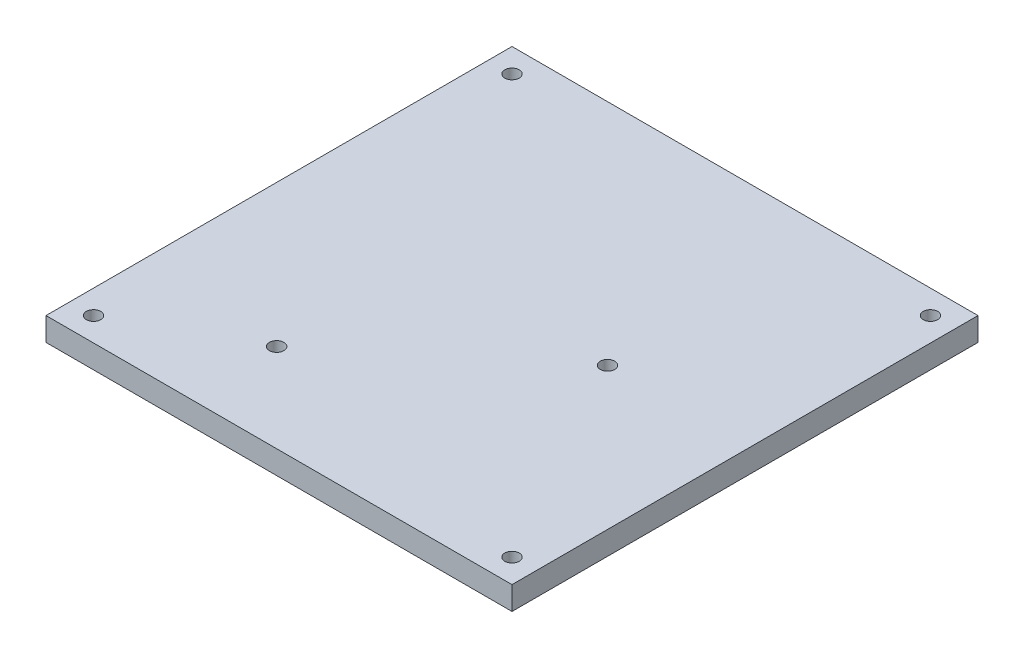
ISO-10303-21;
HEADER;
FILE_DESCRIPTION(('STEP AP214'),'2;1');
FILE_NAME('part.step','',(''),(''),'','','');
FILE_SCHEMA(('AUTOMOTIVE_DESIGN { 1 0 10303 214 1 1 1 1 }'));
ENDSEC;
DATA;
#1=APPLICATION_CONTEXT('core data for automotive mechanical design processes');
#2=APPLICATION_PROTOCOL_DEFINITION('international standard','automotive_design',2000,#1);
#3=PRODUCT_CONTEXT('',#1,'mechanical');
#4=PRODUCT('Part','Part','',(#3));
#5=PRODUCT_RELATED_PRODUCT_CATEGORY('part','',(#4));
#6=PRODUCT_DEFINITION_FORMATION('','',#4);
#7=PRODUCT_DEFINITION_CONTEXT('part definition',#1,'design');
#8=PRODUCT_DEFINITION('design','',#6,#7);
#9=PRODUCT_DEFINITION_SHAPE('','',#8);
#10=(LENGTH_UNIT() NAMED_UNIT(*) SI_UNIT(.MILLI.,.METRE.));
#11=(NAMED_UNIT(*) PLANE_ANGLE_UNIT() SI_UNIT($,.RADIAN.));
#12=(NAMED_UNIT(*) SI_UNIT($,.STERADIAN.) SOLID_ANGLE_UNIT());
#13=UNCERTAINTY_MEASURE_WITH_UNIT(LENGTH_MEASURE(1.E-05),#10,'distance_accuracy_value','');
#14=(GEOMETRIC_REPRESENTATION_CONTEXT(3) GLOBAL_UNCERTAINTY_ASSIGNED_CONTEXT((#13)) GLOBAL_UNIT_ASSIGNED_CONTEXT((#10,
#11,#12)) REPRESENTATION_CONTEXT('',''));
#15=CARTESIAN_POINT('',(0.,0.,0.));
#16=DIRECTION('',(0.,0.,1.));
#17=DIRECTION('',(1.,0.,0.));
#18=AXIS2_PLACEMENT_3D('',#15,#16,#17);
#19=CARTESIAN_POINT('',(0.,5.,0.));
#20=DIRECTION('',(0.,-1.,0.));
#21=DIRECTION('',(0.,0.,-1.));
#22=AXIS2_PLACEMENT_3D('',#19,#20,#21);
#23=PLANE('',#22);
#24=DIRECTION('',(0.,0.,-1.));
#25=VECTOR('',#24,1.);
#26=CARTESIAN_POINT('',(50.,5.,50.));
#27=LINE('',#26,#25);
#28=CARTESIAN_POINT('',(50.,5.,50.));
#29=VERTEX_POINT('',#28);
#30=CARTESIAN_POINT('',(50.,5.,-50.));
#31=VERTEX_POINT('',#30);
#32=EDGE_CURVE('E92',#29,#31,#27,.T.);
#33=ORIENTED_EDGE('',*,*,#32,.T.);
#34=DIRECTION('',(-1.,0.,0.));
#35=VECTOR('',#34,1.);
#36=CARTESIAN_POINT('',(-50.,5.,-50.));
#37=LINE('',#36,#35);
#38=CARTESIAN_POINT('',(-50.,5.,-50.));
#39=VERTEX_POINT('',#38);
#40=EDGE_CURVE('E87',#31,#39,#37,.T.);
#41=ORIENTED_EDGE('',*,*,#40,.T.);
#42=DIRECTION('',(0.,0.,1.));
#43=VECTOR('',#42,1.);
#44=CARTESIAN_POINT('',(-50.,5.,50.));
#45=LINE('',#44,#43);
#46=CARTESIAN_POINT('',(-50.,5.,50.));
#47=VERTEX_POINT('',#46);
#48=EDGE_CURVE('E90',#39,#47,#45,.T.);
#49=ORIENTED_EDGE('',*,*,#48,.T.);
#50=DIRECTION('',(1.,0.,0.));
#51=VECTOR('',#50,1.);
#52=CARTESIAN_POINT('',(-50.,5.,50.));
#53=LINE('',#52,#51);
#54=EDGE_CURVE('E57',#47,#29,#53,.T.);
#55=ORIENTED_EDGE('',*,*,#54,.T.);
#56=EDGE_LOOP('',(#33,#41,#49,#55));
#57=FACE_BOUND('',#56,.T.);
#58=CARTESIAN_POINT('',(-44.9,5.,-44.9));
#59=DIRECTION('',(0.,1.,0.));
#60=DIRECTION('',(0.,0.,1.));
#61=AXIS2_PLACEMENT_3D('',#58,#59,#60);
#62=CIRCLE('',#61,1.55);
#63=CARTESIAN_POINT('',(-44.9,5.,-43.35));
#64=VERTEX_POINT('',#63);
#65=EDGE_CURVE('E112',#64,#64,#62,.T.);
#66=ORIENTED_EDGE('',*,*,#65,.F.);
#67=EDGE_LOOP('',(#66));
#68=FACE_BOUND('',#67,.T.);
#69=CARTESIAN_POINT('',(44.9,5.,-44.9000000000025));
#70=DIRECTION('',(0.,1.,0.));
#71=DIRECTION('',(0.,0.,1.));
#72=AXIS2_PLACEMENT_3D('',#69,#70,#71);
#73=CIRCLE('',#72,1.55);
#74=CARTESIAN_POINT('',(44.9,5.,-43.3500000000025));
#75=VERTEX_POINT('',#74);
#76=EDGE_CURVE('E134',#75,#75,#73,.T.);
#77=ORIENTED_EDGE('',*,*,#76,.F.);
#78=EDGE_LOOP('',(#77));
#79=FACE_BOUND('',#78,.T.);
#80=CARTESIAN_POINT('',(44.9000000000025,5.,44.8999999999975));
#81=DIRECTION('',(0.,1.,0.));
#82=DIRECTION('',(0.,0.,1.));
#83=AXIS2_PLACEMENT_3D('',#80,#81,#82);
#84=CIRCLE('',#83,1.55);
#85=CARTESIAN_POINT('',(44.9000000000025,5.,46.4499999999975));
#86=VERTEX_POINT('',#85);
#87=EDGE_CURVE('E142',#86,#86,#84,.T.);
#88=ORIENTED_EDGE('',*,*,#87,.F.);
#89=EDGE_LOOP('',(#88));
#90=FACE_BOUND('',#89,.T.);
#91=CARTESIAN_POINT('',(-44.8999999999975,5.,44.9));
#92=DIRECTION('',(0.,1.,0.));
#93=DIRECTION('',(0.,0.,1.));
#94=AXIS2_PLACEMENT_3D('',#91,#92,#93);
#95=CIRCLE('',#94,1.55);
#96=CARTESIAN_POINT('',(-44.8999999999975,5.,46.45));
#97=VERTEX_POINT('',#96);
#98=EDGE_CURVE('E150',#97,#97,#95,.T.);
#99=ORIENTED_EDGE('',*,*,#98,.F.);
#100=EDGE_LOOP('',(#99));
#101=FACE_BOUND('',#100,.T.);
#102=CARTESIAN_POINT('',(-19.5,5.,31.0000000000001));
#103=DIRECTION('',(0.,1.,0.));
#104=DIRECTION('',(0.,0.,1.));
#105=AXIS2_PLACEMENT_3D('',#102,#103,#104);
#106=CIRCLE('',#105,1.55000000000001);
#107=CARTESIAN_POINT('',(-19.5,5.,32.5500000000001));
#108=VERTEX_POINT('',#107);
#109=EDGE_CURVE('E158',#108,#108,#106,.T.);
#110=ORIENTED_EDGE('',*,*,#109,.F.);
#111=EDGE_LOOP('',(#110));
#112=FACE_BOUND('',#111,.T.);
#113=CARTESIAN_POINT('',(19.4999999999998,5.,-1.00000000000019));
#114=DIRECTION('',(0.,1.,0.));
#115=DIRECTION('',(0.,0.,1.));
#116=AXIS2_PLACEMENT_3D('',#113,#114,#115);
#117=CIRCLE('',#116,1.54999999999999);
#118=CARTESIAN_POINT('',(19.4999999999998,5.,0.549999999999804));
#119=VERTEX_POINT('',#118);
#120=EDGE_CURVE('E166',#119,#119,#117,.T.);
#121=ORIENTED_EDGE('',*,*,#120,.F.);
#122=EDGE_LOOP('',(#121));
#123=FACE_BOUND('',#122,.T.);
#124=ADVANCED_FACE('F39',(#57,#68,#79,#90,#101,#112,#123),#23,.F.);
#125=CARTESIAN_POINT('',(0.,0.,0.));
#126=DIRECTION('',(0.,-1.,0.));
#127=DIRECTION('',(0.,0.,-1.));
#128=AXIS2_PLACEMENT_3D('',#125,#126,#127);
#129=PLANE('',#128);
#130=CARTESIAN_POINT('',(-19.5,0.,31.0000000000001));
#131=DIRECTION('',(0.,1.,0.));
#132=DIRECTION('',(0.,0.,1.));
#133=AXIS2_PLACEMENT_3D('',#130,#131,#132);
#134=CIRCLE('',#133,1.55000000000001);
#135=CARTESIAN_POINT('',(-19.5,0.,32.5500000000001));
#136=VERTEX_POINT('',#135);
#137=EDGE_CURVE('E162',#136,#136,#134,.T.);
#138=ORIENTED_EDGE('',*,*,#137,.T.);
#139=EDGE_LOOP('',(#138));
#140=FACE_BOUND('',#139,.T.);
#141=CARTESIAN_POINT('',(44.9000000000025,0.,44.8999999999975));
#142=DIRECTION('',(0.,1.,0.));
#143=DIRECTION('',(0.,0.,1.));
#144=AXIS2_PLACEMENT_3D('',#141,#142,#143);
#145=CIRCLE('',#144,1.55);
#146=CARTESIAN_POINT('',(44.9000000000025,0.,46.4499999999975));
#147=VERTEX_POINT('',#146);
#148=EDGE_CURVE('E146',#147,#147,#145,.T.);
#149=ORIENTED_EDGE('',*,*,#148,.T.);
#150=EDGE_LOOP('',(#149));
#151=FACE_BOUND('',#150,.T.);
#152=CARTESIAN_POINT('',(-44.9,0.,-44.9));
#153=DIRECTION('',(0.,1.,0.));
#154=DIRECTION('',(0.,0.,1.));
#155=AXIS2_PLACEMENT_3D('',#152,#153,#154);
#156=CIRCLE('',#155,1.55);
#157=CARTESIAN_POINT('',(-44.9,0.,-43.35));
#158=VERTEX_POINT('',#157);
#159=EDGE_CURVE('E130',#158,#158,#156,.T.);
#160=ORIENTED_EDGE('',*,*,#159,.T.);
#161=EDGE_LOOP('',(#160));
#162=FACE_BOUND('',#161,.T.);
#163=DIRECTION('',(0.,0.,-1.));
#164=VECTOR('',#163,1.);
#165=CARTESIAN_POINT('',(50.,0.,50.));
#166=LINE('',#165,#164);
#167=CARTESIAN_POINT('',(50.,0.,50.));
#168=VERTEX_POINT('',#167);
#169=CARTESIAN_POINT('',(50.,0.,-50.));
#170=VERTEX_POINT('',#169);
#171=EDGE_CURVE('E108',#168,#170,#166,.T.);
#172=ORIENTED_EDGE('',*,*,#171,.F.);
#173=DIRECTION('',(1.,0.,0.));
#174=VECTOR('',#173,1.);
#175=CARTESIAN_POINT('',(-50.,0.,50.));
#176=LINE('',#175,#174);
#177=CARTESIAN_POINT('',(-50.,0.,50.));
#178=VERTEX_POINT('',#177);
#179=EDGE_CURVE('E80',#178,#168,#176,.T.);
#180=ORIENTED_EDGE('',*,*,#179,.F.);
#181=DIRECTION('',(0.,0.,1.));
#182=VECTOR('',#181,1.);
#183=CARTESIAN_POINT('',(-50.,0.,50.));
#184=LINE('',#183,#182);
#185=CARTESIAN_POINT('',(-50.,0.,-50.));
#186=VERTEX_POINT('',#185);
#187=EDGE_CURVE('E74',#186,#178,#184,.T.);
#188=ORIENTED_EDGE('',*,*,#187,.F.);
#189=DIRECTION('',(-1.,0.,0.));
#190=VECTOR('',#189,1.);
#191=CARTESIAN_POINT('',(-50.,0.,-50.));
#192=LINE('',#191,#190);
#193=EDGE_CURVE('E97',#170,#186,#192,.T.);
#194=ORIENTED_EDGE('',*,*,#193,.F.);
#195=EDGE_LOOP('',(#172,#180,#188,#194));
#196=FACE_BOUND('',#195,.T.);
#197=CARTESIAN_POINT('',(44.9,0.,-44.9000000000025));
#198=DIRECTION('',(0.,1.,0.));
#199=DIRECTION('',(0.,0.,1.));
#200=AXIS2_PLACEMENT_3D('',#197,#198,#199);
#201=CIRCLE('',#200,1.55);
#202=CARTESIAN_POINT('',(44.9,0.,-43.3500000000025));
#203=VERTEX_POINT('',#202);
#204=EDGE_CURVE('E138',#203,#203,#201,.T.);
#205=ORIENTED_EDGE('',*,*,#204,.T.);
#206=EDGE_LOOP('',(#205));
#207=FACE_BOUND('',#206,.T.);
#208=CARTESIAN_POINT('',(-44.8999999999975,0.,44.9));
#209=DIRECTION('',(0.,1.,0.));
#210=DIRECTION('',(0.,0.,1.));
#211=AXIS2_PLACEMENT_3D('',#208,#209,#210);
#212=CIRCLE('',#211,1.55);
#213=CARTESIAN_POINT('',(-44.8999999999975,0.,46.45));
#214=VERTEX_POINT('',#213);
#215=EDGE_CURVE('E154',#214,#214,#212,.T.);
#216=ORIENTED_EDGE('',*,*,#215,.T.);
#217=EDGE_LOOP('',(#216));
#218=FACE_BOUND('',#217,.T.);
#219=CARTESIAN_POINT('',(19.4999999999998,0.,-1.00000000000019));
#220=DIRECTION('',(0.,1.,0.));
#221=DIRECTION('',(0.,0.,1.));
#222=AXIS2_PLACEMENT_3D('',#219,#220,#221);
#223=CIRCLE('',#222,1.54999999999999);
#224=CARTESIAN_POINT('',(19.4999999999998,0.,0.549999999999804));
#225=VERTEX_POINT('',#224);
#226=EDGE_CURVE('E170',#225,#225,#223,.T.);
#227=ORIENTED_EDGE('',*,*,#226,.T.);
#228=EDGE_LOOP('',(#227));
#229=FACE_BOUND('',#228,.T.);
#230=ADVANCED_FACE('F125',(#140,#151,#162,#196,#207,#218,#229),#129,.T.);
#231=CARTESIAN_POINT('',(50.,5.,50.));
#232=DIRECTION('',(-1.,0.,0.));
#233=DIRECTION('',(0.,0.,1.));
#234=AXIS2_PLACEMENT_3D('',#231,#232,#233);
#235=PLANE('',#234);
#236=ORIENTED_EDGE('',*,*,#171,.T.);
#237=DIRECTION('',(0.,-1.,0.));
#238=VECTOR('',#237,1.);
#239=CARTESIAN_POINT('',(50.,5.,-50.));
#240=LINE('',#239,#238);
#241=EDGE_CURVE('E11',#31,#170,#240,.T.);
#242=ORIENTED_EDGE('',*,*,#241,.F.);
#243=ORIENTED_EDGE('',*,*,#32,.F.);
#244=DIRECTION('',(0.,-1.,0.));
#245=VECTOR('',#244,1.);
#246=CARTESIAN_POINT('',(50.,5.,50.));
#247=LINE('',#246,#245);
#248=EDGE_CURVE('E104',#29,#168,#247,.T.);
#249=ORIENTED_EDGE('',*,*,#248,.T.);
#250=EDGE_LOOP('',(#236,#242,#243,#249));
#251=FACE_BOUND('',#250,.T.);
#252=ADVANCED_FACE('F41',(#251),#235,.F.);
#253=CARTESIAN_POINT('',(-50.,5.,-50.));
#254=DIRECTION('',(0.,0.,1.));
#255=DIRECTION('',(1.,0.,0.));
#256=AXIS2_PLACEMENT_3D('',#253,#254,#255);
#257=PLANE('',#256);
#258=ORIENTED_EDGE('',*,*,#193,.T.);
#259=DIRECTION('',(0.,-1.,0.));
#260=VECTOR('',#259,1.);
#261=CARTESIAN_POINT('',(-50.,5.,-50.));
#262=LINE('',#261,#260);
#263=EDGE_CURVE('E49',#39,#186,#262,.T.);
#264=ORIENTED_EDGE('',*,*,#263,.F.);
#265=ORIENTED_EDGE('',*,*,#40,.F.);
#266=ORIENTED_EDGE('',*,*,#241,.T.);
#267=EDGE_LOOP('',(#258,#264,#265,#266));
#268=FACE_BOUND('',#267,.T.);
#269=ADVANCED_FACE('F96',(#268),#257,.F.);
#270=CARTESIAN_POINT('',(-50.,5.,50.));
#271=DIRECTION('',(1.,0.,0.));
#272=DIRECTION('',(0.,0.,-1.));
#273=AXIS2_PLACEMENT_3D('',#270,#271,#272);
#274=PLANE('',#273);
#275=ORIENTED_EDGE('',*,*,#187,.T.);
#276=DIRECTION('',(0.,-1.,0.));
#277=VECTOR('',#276,1.);
#278=CARTESIAN_POINT('',(-50.,5.,50.));
#279=LINE('',#278,#277);
#280=EDGE_CURVE('E99',#47,#178,#279,.T.);
#281=ORIENTED_EDGE('',*,*,#280,.F.);
#282=ORIENTED_EDGE('',*,*,#48,.F.);
#283=ORIENTED_EDGE('',*,*,#263,.T.);
#284=EDGE_LOOP('',(#275,#281,#282,#283));
#285=FACE_BOUND('',#284,.T.);
#286=ADVANCED_FACE('F100',(#285),#274,.F.);
#287=CARTESIAN_POINT('',(-50.,5.,50.));
#288=DIRECTION('',(0.,0.,-1.));
#289=DIRECTION('',(-1.,0.,0.));
#290=AXIS2_PLACEMENT_3D('',#287,#288,#289);
#291=PLANE('',#290);
#292=ORIENTED_EDGE('',*,*,#179,.T.);
#293=ORIENTED_EDGE('',*,*,#248,.F.);
#294=ORIENTED_EDGE('',*,*,#54,.F.);
#295=ORIENTED_EDGE('',*,*,#280,.T.);
#296=EDGE_LOOP('',(#292,#293,#294,#295));
#297=FACE_BOUND('',#296,.T.);
#298=ADVANCED_FACE('F122',(#297),#291,.F.);
#299=CARTESIAN_POINT('',(-44.9,5.,-44.9));
#300=DIRECTION('',(0.,-1.,0.));
#301=DIRECTION('',(0.,0.,-1.));
#302=AXIS2_PLACEMENT_3D('',#299,#300,#301);
#303=CYLINDRICAL_SURFACE('',#302,1.55);
#304=ORIENTED_EDGE('',*,*,#65,.T.);
#305=EDGE_LOOP('',(#304));
#306=FACE_BOUND('',#305,.T.);
#307=ORIENTED_EDGE('',*,*,#159,.F.);
#308=EDGE_LOOP('',(#307));
#309=FACE_BOUND('',#308,.T.);
#310=ADVANCED_FACE('F189',(#306,#309),#303,.F.);
#311=CARTESIAN_POINT('',(44.9,5.,-44.9000000000025));
#312=DIRECTION('',(0.,-1.,0.));
#313=DIRECTION('',(0.,0.,-1.));
#314=AXIS2_PLACEMENT_3D('',#311,#312,#313);
#315=CYLINDRICAL_SURFACE('',#314,1.55);
#316=ORIENTED_EDGE('',*,*,#76,.T.);
#317=EDGE_LOOP('',(#316));
#318=FACE_BOUND('',#317,.T.);
#319=ORIENTED_EDGE('',*,*,#204,.F.);
#320=EDGE_LOOP('',(#319));
#321=FACE_BOUND('',#320,.T.);
#322=ADVANCED_FACE('F235',(#318,#321),#315,.F.);
#323=CARTESIAN_POINT('',(44.9000000000025,5.,44.8999999999975));
#324=DIRECTION('',(0.,-1.,0.));
#325=DIRECTION('',(0.,0.,-1.));
#326=AXIS2_PLACEMENT_3D('',#323,#324,#325);
#327=CYLINDRICAL_SURFACE('',#326,1.55);
#328=ORIENTED_EDGE('',*,*,#87,.T.);
#329=EDGE_LOOP('',(#328));
#330=FACE_BOUND('',#329,.T.);
#331=ORIENTED_EDGE('',*,*,#148,.F.);
#332=EDGE_LOOP('',(#331));
#333=FACE_BOUND('',#332,.T.);
#334=ADVANCED_FACE('F243',(#330,#333),#327,.F.);
#335=CARTESIAN_POINT('',(-44.8999999999975,5.,44.9));
#336=DIRECTION('',(0.,-1.,0.));
#337=DIRECTION('',(0.,0.,-1.));
#338=AXIS2_PLACEMENT_3D('',#335,#336,#337);
#339=CYLINDRICAL_SURFACE('',#338,1.55);
#340=ORIENTED_EDGE('',*,*,#98,.T.);
#341=EDGE_LOOP('',(#340));
#342=FACE_BOUND('',#341,.T.);
#343=ORIENTED_EDGE('',*,*,#215,.F.);
#344=EDGE_LOOP('',(#343));
#345=FACE_BOUND('',#344,.T.);
#346=ADVANCED_FACE('F251',(#342,#345),#339,.F.);
#347=CARTESIAN_POINT('',(-19.5,5.,31.0000000000001));
#348=DIRECTION('',(0.,-1.,0.));
#349=DIRECTION('',(0.,0.,-1.));
#350=AXIS2_PLACEMENT_3D('',#347,#348,#349);
#351=CYLINDRICAL_SURFACE('',#350,1.55000000000001);
#352=ORIENTED_EDGE('',*,*,#109,.T.);
#353=EDGE_LOOP('',(#352));
#354=FACE_BOUND('',#353,.T.);
#355=ORIENTED_EDGE('',*,*,#137,.F.);
#356=EDGE_LOOP('',(#355));
#357=FACE_BOUND('',#356,.T.);
#358=ADVANCED_FACE('F260',(#354,#357),#351,.F.);
#359=CARTESIAN_POINT('',(19.4999999999998,5.,-1.00000000000019));
#360=DIRECTION('',(0.,-1.,0.));
#361=DIRECTION('',(0.,0.,-1.));
#362=AXIS2_PLACEMENT_3D('',#359,#360,#361);
#363=CYLINDRICAL_SURFACE('',#362,1.54999999999999);
#364=ORIENTED_EDGE('',*,*,#120,.T.);
#365=EDGE_LOOP('',(#364));
#366=FACE_BOUND('',#365,.T.);
#367=ORIENTED_EDGE('',*,*,#226,.F.);
#368=EDGE_LOOP('',(#367));
#369=FACE_BOUND('',#368,.T.);
#370=ADVANCED_FACE('F178',(#366,#369),#363,.F.);
#371=CLOSED_SHELL('',(#124,#230,#252,#269,#286,#298,#310,#322,#334,#346,#358,#370));
#372=MANIFOLD_SOLID_BREP('B2',#371);
#373=ADVANCED_BREP_SHAPE_REPRESENTATION('',(#18,#372),#14);
#374=SHAPE_DEFINITION_REPRESENTATION(#9,#373);
ENDSEC;
END-ISO-10303-21;
